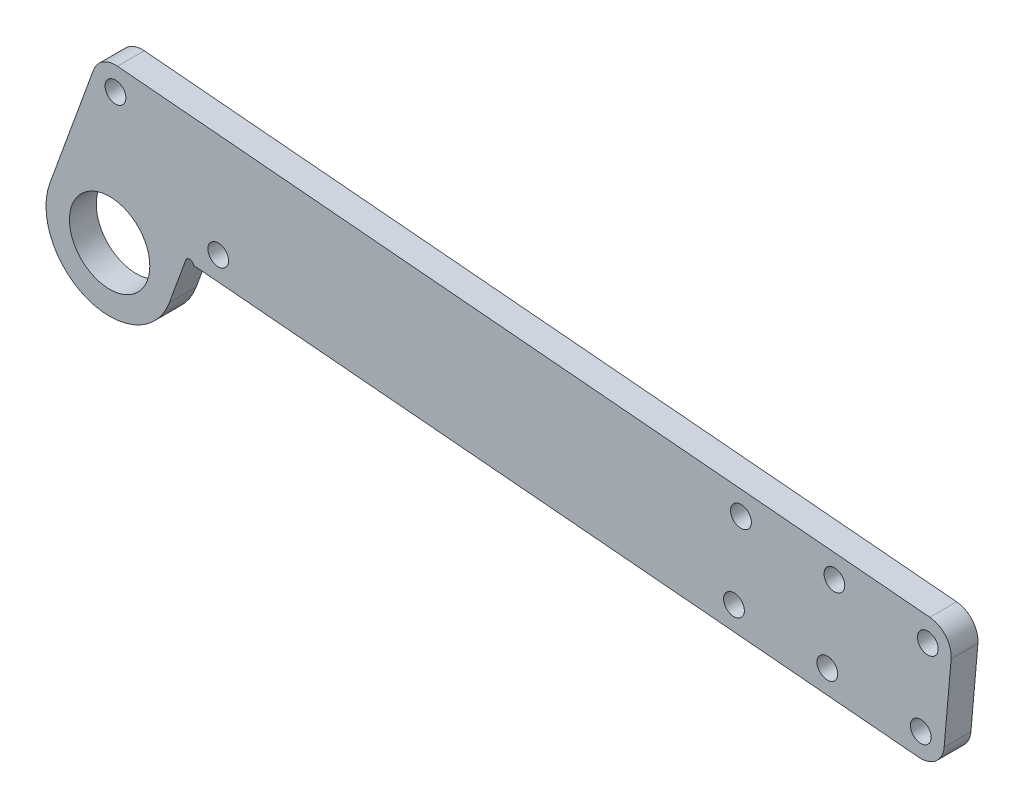
ISO-10303-21;
HEADER;
FILE_DESCRIPTION(('STEP AP214'),'2;1');
FILE_NAME('part.step','',(''),(''),'','','');
FILE_SCHEMA(('AUTOMOTIVE_DESIGN { 1 0 10303 214 1 1 1 1 }'));
ENDSEC;
DATA;
#1=APPLICATION_CONTEXT('core data for automotive mechanical design processes');
#2=APPLICATION_PROTOCOL_DEFINITION('international standard','automotive_design',2000,#1);
#3=PRODUCT_CONTEXT('',#1,'mechanical');
#4=PRODUCT('Part','Part','',(#3));
#5=PRODUCT_RELATED_PRODUCT_CATEGORY('part','',(#4));
#6=PRODUCT_DEFINITION_FORMATION('','',#4);
#7=PRODUCT_DEFINITION_CONTEXT('part definition',#1,'design');
#8=PRODUCT_DEFINITION('design','',#6,#7);
#9=PRODUCT_DEFINITION_SHAPE('','',#8);
#10=(LENGTH_UNIT() NAMED_UNIT(*) SI_UNIT(.MILLI.,.METRE.));
#11=(NAMED_UNIT(*) PLANE_ANGLE_UNIT() SI_UNIT($,.RADIAN.));
#12=(NAMED_UNIT(*) SI_UNIT($,.STERADIAN.) SOLID_ANGLE_UNIT());
#13=UNCERTAINTY_MEASURE_WITH_UNIT(LENGTH_MEASURE(1.E-05),#10,'distance_accuracy_value','');
#14=(GEOMETRIC_REPRESENTATION_CONTEXT(3) GLOBAL_UNCERTAINTY_ASSIGNED_CONTEXT((#13)) GLOBAL_UNIT_ASSIGNED_CONTEXT((#10,
#11,#12)) REPRESENTATION_CONTEXT('',''));
#15=CARTESIAN_POINT('',(0.,0.,0.));
#16=DIRECTION('',(0.,0.,1.));
#17=DIRECTION('',(1.,0.,0.));
#18=AXIS2_PLACEMENT_3D('',#15,#16,#17);
#19=CARTESIAN_POINT('',(0.,0.,2.));
#20=DIRECTION('',(0.,0.,1.));
#21=DIRECTION('',(1.,0.,0.));
#22=AXIS2_PLACEMENT_3D('',#19,#20,#21);
#23=PLANE('',#22);
#24=CARTESIAN_POINT('',(108.222712806669,10.5528446828025,2.));
#25=DIRECTION('',(0.,0.,1.));
#26=DIRECTION('',(1.,0.,0.));
#27=AXIS2_PLACEMENT_3D('',#24,#25,#26);
#28=CIRCLE('',#27,1.54999999999999);
#29=CARTESIAN_POINT('',(109.772712806669,10.5528446828025,2.));
#30=VERTEX_POINT('',#29);
#31=EDGE_CURVE('E436',#30,#30,#28,.T.);
#32=ORIENTED_EDGE('',*,*,#31,.F.);
#33=EDGE_LOOP('',(#32));
#34=FACE_BOUND('',#33,.T.);
#35=CARTESIAN_POINT('',(93.230118120413,-0.181311295831196,2.));
#36=DIRECTION('',(0.,0.,1.));
#37=DIRECTION('',(1.,0.,0.));
#38=AXIS2_PLACEMENT_3D('',#35,#36,#37);
#39=CIRCLE('',#38,1.54999999999999);
#40=CARTESIAN_POINT('',(94.780118120413,-0.181311295831196,2.));
#41=VERTEX_POINT('',#40);
#42=EDGE_CURVE('E439',#41,#41,#39,.T.);
#43=ORIENTED_EDGE('',*,*,#42,.F.);
#44=EDGE_LOOP('',(#43));
#45=FACE_BOUND('',#44,.T.);
#46=CARTESIAN_POINT('',(94.2759870333849,11.7730250812698,2.));
#47=DIRECTION('',(0.,0.,1.));
#48=DIRECTION('',(1.,0.,0.));
#49=AXIS2_PLACEMENT_3D('',#46,#47,#48);
#50=CIRCLE('',#49,1.54999999999999);
#51=CARTESIAN_POINT('',(95.8259870333849,11.7730250812698,2.));
#52=VERTEX_POINT('',#51);
#53=EDGE_CURVE('E455',#52,#52,#50,.T.);
#54=ORIENTED_EDGE('',*,*,#53,.F.);
#55=EDGE_LOOP('',(#54));
#56=FACE_BOUND('',#55,.T.);
#57=CARTESIAN_POINT('',(121.123569666982,-2.62167209276562,2.));
#58=DIRECTION('',(0.,0.,1.));
#59=DIRECTION('',(1.,0.,0.));
#60=AXIS2_PLACEMENT_3D('',#57,#58,#59);
#61=CIRCLE('',#60,1.54999999999999);
#62=CARTESIAN_POINT('',(122.673569666982,-2.62167209276562,2.));
#63=VERTEX_POINT('',#62);
#64=EDGE_CURVE('E449',#63,#63,#61,.T.);
#65=ORIENTED_EDGE('',*,*,#64,.F.);
#66=EDGE_LOOP('',(#65));
#67=FACE_BOUND('',#66,.T.);
#68=CARTESIAN_POINT('',(107.176843893697,-1.40149169429841,2.));
#69=DIRECTION('',(0.,0.,1.));
#70=DIRECTION('',(1.,0.,0.));
#71=AXIS2_PLACEMENT_3D('',#68,#69,#70);
#72=CIRCLE('',#71,1.54999999999999);
#73=CARTESIAN_POINT('',(108.726843893697,-1.40149169429841,2.));
#74=VERTEX_POINT('',#73);
#75=EDGE_CURVE('E442',#74,#74,#72,.T.);
#76=ORIENTED_EDGE('',*,*,#75,.F.);
#77=EDGE_LOOP('',(#76));
#78=FACE_BOUND('',#77,.T.);
#79=CARTESIAN_POINT('',(122.169438579954,9.33266428433532,2.));
#80=DIRECTION('',(0.,0.,1.));
#81=DIRECTION('',(1.,0.,0.));
#82=AXIS2_PLACEMENT_3D('',#79,#80,#81);
#83=CIRCLE('',#82,1.54999999999999);
#84=CARTESIAN_POINT('',(123.719438579954,9.33266428433532,2.));
#85=VERTEX_POINT('',#84);
#86=EDGE_CURVE('E200',#85,#85,#83,.T.);
#87=ORIENTED_EDGE('',*,*,#86,.F.);
#88=EDGE_LOOP('',(#87));
#89=FACE_BOUND('',#88,.T.);
#90=DIRECTION('',(0.996194698091746,-0.0871557427476583,0.));
#91=VECTOR('',#90,1.);
#92=CARTESIAN_POINT('',(11.3715785534696,3.46701349766295,2.));
#93=LINE('',#92,#91);
#94=CARTESIAN_POINT('',(12.5262787777485,3.3659903182677,2.));
#95=VERTEX_POINT('',#94);
#96=CARTESIAN_POINT('',(120.818524567365,-6.10835353608674,2.));
#97=VERTEX_POINT('',#96);
#98=EDGE_CURVE('E127',#95,#97,#93,.T.);
#99=ORIENTED_EDGE('',*,*,#98,.T.);
#100=CARTESIAN_POINT('',(121.123569666982,-2.62167209276563,2.));
#101=DIRECTION('',(0.,0.,1.));
#102=DIRECTION('',(1.,0.,0.));
#103=AXIS2_PLACEMENT_3D('',#100,#101,#102);
#104=CIRCLE('',#103,3.5);
#105=CARTESIAN_POINT('',(124.610251110303,-2.92671719238244,2.));
#106=VERTEX_POINT('',#105);
#107=EDGE_CURVE('E179',#97,#106,#104,.T.);
#108=ORIENTED_EDGE('',*,*,#107,.T.);
#109=DIRECTION('',(-0.0871557427476583,-0.996194698091746,0.));
#110=VECTOR('',#109,1.);
#111=CARTESIAN_POINT('',(125.961165122892,12.5143006280396,2.));
#112=LINE('',#111,#110);
#113=CARTESIAN_POINT('',(125.656120023275,9.02761918471851,2.));
#114=VERTEX_POINT('',#113);
#115=EDGE_CURVE('E193',#114,#106,#112,.T.);
#116=ORIENTED_EDGE('',*,*,#115,.F.);
#117=CARTESIAN_POINT('',(122.169438579954,9.33266428433532,2.));
#118=DIRECTION('',(0.,0.,1.));
#119=DIRECTION('',(1.,0.,0.));
#120=AXIS2_PLACEMENT_3D('',#117,#118,#119);
#121=CIRCLE('',#120,3.5);
#122=CARTESIAN_POINT('',(122.474483679571,12.8193457276564,2.));
#123=VERTEX_POINT('',#122);
#124=EDGE_CURVE('E177',#114,#123,#121,.T.);
#125=ORIENTED_EDGE('',*,*,#124,.T.);
#126=DIRECTION('',(-0.996194698091746,0.0871557427476583,0.));
#127=VECTOR('',#126,1.);
#128=CARTESIAN_POINT('',(-1.49619679974456,23.6653748791911,2.));
#129=LINE('',#128,#127);
#130=CARTESIAN_POINT('',(1.17922797020117,23.4313055417044,2.));
#131=VERTEX_POINT('',#130);
#132=EDGE_CURVE('E137',#123,#131,#129,.T.);
#133=ORIENTED_EDGE('',*,*,#132,.T.);
#134=CARTESIAN_POINT('',(0.874182870584366,19.9446240983833,2.));
#135=DIRECTION('',(0.,0.,1.));
#136=DIRECTION('',(1.,0.,0.));
#137=AXIS2_PLACEMENT_3D('',#134,#135,#136);
#138=CIRCLE('',#137,3.5);
#139=CARTESIAN_POINT('',(-2.41474130216632,21.1416946000231,2.));
#140=VERTEX_POINT('',#139);
#141=EDGE_CURVE('E174',#131,#140,#138,.T.);
#142=ORIENTED_EDGE('',*,*,#141,.T.);
#143=DIRECTION('',(-0.342020143325666,-0.939692620785909,0.));
#144=VECTOR('',#143,1.);
#145=CARTESIAN_POINT('',(-8.92707989746614,3.24919136159382,2.));
#146=LINE('',#145,#144);
#147=CARTESIAN_POINT('',(-8.92707989746614,3.24919136159382,2.));
#148=VERTEX_POINT('',#147);
#149=EDGE_CURVE('E139',#140,#148,#146,.T.);
#150=ORIENTED_EDGE('',*,*,#149,.T.);
#151=CARTESIAN_POINT('',(0.,0.,2.));
#152=DIRECTION('',(0.,0.,1.));
#153=DIRECTION('',(1.,0.,0.));
#154=AXIS2_PLACEMENT_3D('',#151,#152,#153);
#155=CIRCLE('',#154,9.5);
#156=CARTESIAN_POINT('',(8.92707989746614,-3.24919136159382,2.));
#157=VERTEX_POINT('',#156);
#158=EDGE_CURVE('E141',#148,#157,#155,.T.);
#159=ORIENTED_EDGE('',*,*,#158,.T.);
#160=DIRECTION('',(0.342020143325666,0.939692620785909,0.));
#161=VECTOR('',#160,1.);
#162=CARTESIAN_POINT('',(8.92707989746614,-3.24919136159382,2.));
#163=LINE('',#162,#161);
#164=CARTESIAN_POINT('',(11.3715785534696,3.46701349766295,2.));
#165=VERTEX_POINT('',#164);
#166=EDGE_CURVE('E129',#157,#165,#163,.T.);
#167=ORIENTED_EDGE('',*,*,#166,.T.);
#168=CARTESIAN_POINT('',(11.9353941259412,3.26180141166755,2.));
#169=DIRECTION('',(0.,0.,1.));
#170=DIRECTION('',(1.,0.,0.));
#171=AXIS2_PLACEMENT_3D('',#168,#169,#170);
#172=CIRCLE('',#171,0.6);
#173=EDGE_CURVE('E113',#95,#165,#172,.T.);
#174=ORIENTED_EDGE('',*,*,#173,.F.);
#175=EDGE_LOOP('',(#99,#108,#116,#125,#133,#142,#150,#159,#167,#174));
#176=FACE_BOUND('',#175,.T.);
#177=CARTESIAN_POINT('',(0.874182870584366,19.9446240983833,2.));
#178=DIRECTION('',(0.,0.,1.));
#179=DIRECTION('',(1.,0.,0.));
#180=AXIS2_PLACEMENT_3D('',#177,#178,#179);
#181=CIRCLE('',#180,1.55);
#182=CARTESIAN_POINT('',(2.42418287058437,19.9446240983833,2.));
#183=VERTEX_POINT('',#182);
#184=EDGE_CURVE('E208',#183,#183,#181,.T.);
#185=ORIENTED_EDGE('',*,*,#184,.F.);
#186=EDGE_LOOP('',(#185));
#187=FACE_BOUND('',#186,.T.);
#188=CARTESIAN_POINT('',(16.2205553770371,6.55615242730257,2.));
#189=DIRECTION('',(0.,0.,1.));
#190=DIRECTION('',(1.,0.,0.));
#191=AXIS2_PLACEMENT_3D('',#188,#189,#190);
#192=CIRCLE('',#191,1.55);
#193=CARTESIAN_POINT('',(17.7705553770371,6.55615242730257,2.));
#194=VERTEX_POINT('',#193);
#195=EDGE_CURVE('E214',#194,#194,#192,.T.);
#196=ORIENTED_EDGE('',*,*,#195,.F.);
#197=EDGE_LOOP('',(#196));
#198=FACE_BOUND('',#197,.T.);
#199=CARTESIAN_POINT('',(0.,0.,2.));
#200=DIRECTION('',(0.,0.,1.));
#201=DIRECTION('',(1.,0.,0.));
#202=AXIS2_PLACEMENT_3D('',#199,#200,#201);
#203=CIRCLE('',#202,6.);
#204=CARTESIAN_POINT('',(6.,0.,2.));
#205=VERTEX_POINT('',#204);
#206=EDGE_CURVE('E151',#205,#205,#203,.T.);
#207=ORIENTED_EDGE('',*,*,#206,.F.);
#208=EDGE_LOOP('',(#207));
#209=FACE_BOUND('',#208,.T.);
#210=ADVANCED_FACE('F33',(#34,#45,#56,#67,#78,#89,#176,#187,#198,#209),#23,.T.);
#211=CARTESIAN_POINT('',(0.,0.,-2.));
#212=DIRECTION('',(0.,0.,1.));
#213=DIRECTION('',(1.,0.,0.));
#214=AXIS2_PLACEMENT_3D('',#211,#212,#213);
#215=PLANE('',#214);
#216=CARTESIAN_POINT('',(108.222712806669,10.5528446828025,-2.));
#217=DIRECTION('',(0.,0.,1.));
#218=DIRECTION('',(1.,0.,0.));
#219=AXIS2_PLACEMENT_3D('',#216,#217,#218);
#220=CIRCLE('',#219,1.54999999999999);
#221=CARTESIAN_POINT('',(109.772712806669,10.5528446828025,-2.));
#222=VERTEX_POINT('',#221);
#223=EDGE_CURVE('E434',#222,#222,#220,.T.);
#224=ORIENTED_EDGE('',*,*,#223,.T.);
#225=EDGE_LOOP('',(#224));
#226=FACE_BOUND('',#225,.T.);
#227=CARTESIAN_POINT('',(93.230118120413,-0.181311295831196,-2.));
#228=DIRECTION('',(0.,0.,1.));
#229=DIRECTION('',(1.,0.,0.));
#230=AXIS2_PLACEMENT_3D('',#227,#228,#229);
#231=CIRCLE('',#230,1.54999999999999);
#232=CARTESIAN_POINT('',(94.780118120413,-0.181311295831196,-2.));
#233=VERTEX_POINT('',#232);
#234=EDGE_CURVE('E457',#233,#233,#231,.T.);
#235=ORIENTED_EDGE('',*,*,#234,.T.);
#236=EDGE_LOOP('',(#235));
#237=FACE_BOUND('',#236,.T.);
#238=CARTESIAN_POINT('',(94.2759870333849,11.7730250812698,-2.));
#239=DIRECTION('',(0.,0.,1.));
#240=DIRECTION('',(1.,0.,0.));
#241=AXIS2_PLACEMENT_3D('',#238,#239,#240);
#242=CIRCLE('',#241,1.54999999999999);
#243=CARTESIAN_POINT('',(95.8259870333849,11.7730250812698,-2.));
#244=VERTEX_POINT('',#243);
#245=EDGE_CURVE('E452',#244,#244,#242,.T.);
#246=ORIENTED_EDGE('',*,*,#245,.T.);
#247=EDGE_LOOP('',(#246));
#248=FACE_BOUND('',#247,.T.);
#249=CARTESIAN_POINT('',(121.123569666982,-2.62167209276562,-2.));
#250=DIRECTION('',(0.,0.,1.));
#251=DIRECTION('',(1.,0.,0.));
#252=AXIS2_PLACEMENT_3D('',#249,#250,#251);
#253=CIRCLE('',#252,1.54999999999999);
#254=CARTESIAN_POINT('',(122.673569666982,-2.62167209276562,-2.));
#255=VERTEX_POINT('',#254);
#256=EDGE_CURVE('E446',#255,#255,#253,.T.);
#257=ORIENTED_EDGE('',*,*,#256,.T.);
#258=EDGE_LOOP('',(#257));
#259=FACE_BOUND('',#258,.T.);
#260=CARTESIAN_POINT('',(107.176843893697,-1.40149169429841,-2.));
#261=DIRECTION('',(0.,0.,1.));
#262=DIRECTION('',(1.,0.,0.));
#263=AXIS2_PLACEMENT_3D('',#260,#261,#262);
#264=CIRCLE('',#263,1.54999999999999);
#265=CARTESIAN_POINT('',(108.726843893697,-1.40149169429841,-2.));
#266=VERTEX_POINT('',#265);
#267=EDGE_CURVE('E437',#266,#266,#264,.T.);
#268=ORIENTED_EDGE('',*,*,#267,.T.);
#269=EDGE_LOOP('',(#268));
#270=FACE_BOUND('',#269,.T.);
#271=CARTESIAN_POINT('',(122.169438579954,9.33266428433532,-2.));
#272=DIRECTION('',(0.,0.,1.));
#273=DIRECTION('',(1.,0.,0.));
#274=AXIS2_PLACEMENT_3D('',#271,#272,#273);
#275=CIRCLE('',#274,1.54999999999999);
#276=CARTESIAN_POINT('',(123.719438579954,9.33266428433532,-2.));
#277=VERTEX_POINT('',#276);
#278=EDGE_CURVE('E196',#277,#277,#275,.T.);
#279=ORIENTED_EDGE('',*,*,#278,.T.);
#280=EDGE_LOOP('',(#279));
#281=FACE_BOUND('',#280,.T.);
#282=CARTESIAN_POINT('',(0.874182870584366,19.9446240983833,-2.));
#283=DIRECTION('',(0.,0.,1.));
#284=DIRECTION('',(1.,0.,0.));
#285=AXIS2_PLACEMENT_3D('',#282,#283,#284);
#286=CIRCLE('',#285,1.55);
#287=CARTESIAN_POINT('',(2.42418287058437,19.9446240983833,-2.));
#288=VERTEX_POINT('',#287);
#289=EDGE_CURVE('E204',#288,#288,#286,.T.);
#290=ORIENTED_EDGE('',*,*,#289,.T.);
#291=EDGE_LOOP('',(#290));
#292=FACE_BOUND('',#291,.T.);
#293=CARTESIAN_POINT('',(16.2205553770371,6.55615242730257,-2.));
#294=DIRECTION('',(0.,0.,1.));
#295=DIRECTION('',(1.,0.,0.));
#296=AXIS2_PLACEMENT_3D('',#293,#294,#295);
#297=CIRCLE('',#296,1.55);
#298=CARTESIAN_POINT('',(17.7705553770371,6.55615242730257,-2.));
#299=VERTEX_POINT('',#298);
#300=EDGE_CURVE('E211',#299,#299,#297,.T.);
#301=ORIENTED_EDGE('',*,*,#300,.T.);
#302=EDGE_LOOP('',(#301));
#303=FACE_BOUND('',#302,.T.);
#304=DIRECTION('',(-0.0871557427476583,-0.996194698091746,0.));
#305=VECTOR('',#304,1.);
#306=CARTESIAN_POINT('',(125.961165122892,12.5143006280396,-2.));
#307=LINE('',#306,#305);
#308=CARTESIAN_POINT('',(125.656120023275,9.02761918471851,-2.));
#309=VERTEX_POINT('',#308);
#310=CARTESIAN_POINT('',(124.610251110303,-2.92671719238244,-2.));
#311=VERTEX_POINT('',#310);
#312=EDGE_CURVE('E131',#309,#311,#307,.T.);
#313=ORIENTED_EDGE('',*,*,#312,.T.);
#314=CARTESIAN_POINT('',(121.123569666982,-2.62167209276563,-2.));
#315=DIRECTION('',(0.,0.,1.));
#316=DIRECTION('',(1.,0.,0.));
#317=AXIS2_PLACEMENT_3D('',#314,#315,#316);
#318=CIRCLE('',#317,3.5);
#319=CARTESIAN_POINT('',(120.818524567365,-6.10835353608674,-2.));
#320=VERTEX_POINT('',#319);
#321=EDGE_CURVE('E41',#311,#320,#318,.F.);
#322=ORIENTED_EDGE('',*,*,#321,.T.);
#323=DIRECTION('',(0.996194698091746,-0.0871557427476583,0.));
#324=VECTOR('',#323,1.);
#325=CARTESIAN_POINT('',(11.3715785534696,3.46701349766295,-2.));
#326=LINE('',#325,#324);
#327=CARTESIAN_POINT('',(12.5262787777485,3.3659903182677,-2.));
#328=VERTEX_POINT('',#327);
#329=EDGE_CURVE('E154',#328,#320,#326,.T.);
#330=ORIENTED_EDGE('',*,*,#329,.F.);
#331=CARTESIAN_POINT('',(11.9353941259412,3.26180141166755,-2.));
#332=DIRECTION('',(0.,0.,1.));
#333=DIRECTION('',(1.,0.,0.));
#334=AXIS2_PLACEMENT_3D('',#331,#332,#333);
#335=CIRCLE('',#334,0.6);
#336=CARTESIAN_POINT('',(11.3715785534696,3.46701349766295,-2.));
#337=VERTEX_POINT('',#336);
#338=EDGE_CURVE('E116',#328,#337,#335,.T.);
#339=ORIENTED_EDGE('',*,*,#338,.T.);
#340=DIRECTION('',(0.342020143325666,0.939692620785909,0.));
#341=VECTOR('',#340,1.);
#342=CARTESIAN_POINT('',(8.92707989746614,-3.24919136159382,-2.));
#343=LINE('',#342,#341);
#344=CARTESIAN_POINT('',(8.92707989746614,-3.24919136159382,-2.));
#345=VERTEX_POINT('',#344);
#346=EDGE_CURVE('E150',#345,#337,#343,.T.);
#347=ORIENTED_EDGE('',*,*,#346,.F.);
#348=CARTESIAN_POINT('',(0.,0.,-2.));
#349=DIRECTION('',(0.,0.,1.));
#350=DIRECTION('',(1.,0.,0.));
#351=AXIS2_PLACEMENT_3D('',#348,#349,#350);
#352=CIRCLE('',#351,9.5);
#353=CARTESIAN_POINT('',(-8.92707989746614,3.24919136159382,-2.));
#354=VERTEX_POINT('',#353);
#355=EDGE_CURVE('E147',#354,#345,#352,.T.);
#356=ORIENTED_EDGE('',*,*,#355,.F.);
#357=DIRECTION('',(-0.342020143325666,-0.939692620785909,0.));
#358=VECTOR('',#357,1.);
#359=CARTESIAN_POINT('',(-8.92707989746614,3.24919136159382,-2.));
#360=LINE('',#359,#358);
#361=CARTESIAN_POINT('',(-2.41474130216632,21.1416946000231,-2.));
#362=VERTEX_POINT('',#361);
#363=EDGE_CURVE('E158',#362,#354,#360,.T.);
#364=ORIENTED_EDGE('',*,*,#363,.F.);
#365=CARTESIAN_POINT('',(0.874182870584366,19.9446240983833,-2.));
#366=DIRECTION('',(0.,0.,1.));
#367=DIRECTION('',(1.,0.,0.));
#368=AXIS2_PLACEMENT_3D('',#365,#366,#367);
#369=CIRCLE('',#368,3.5);
#370=CARTESIAN_POINT('',(1.17922797020117,23.4313055417044,-2.));
#371=VERTEX_POINT('',#370);
#372=EDGE_CURVE('E168',#362,#371,#369,.F.);
#373=ORIENTED_EDGE('',*,*,#372,.T.);
#374=DIRECTION('',(-0.996194698091746,0.0871557427476583,0.));
#375=VECTOR('',#374,1.);
#376=CARTESIAN_POINT('',(-1.49619679974456,23.6653748791911,-2.));
#377=LINE('',#376,#375);
#378=CARTESIAN_POINT('',(122.474483679571,12.8193457276564,-2.));
#379=VERTEX_POINT('',#378);
#380=EDGE_CURVE('E156',#379,#371,#377,.T.);
#381=ORIENTED_EDGE('',*,*,#380,.F.);
#382=CARTESIAN_POINT('',(122.169438579954,9.33266428433532,-2.));
#383=DIRECTION('',(0.,0.,1.));
#384=DIRECTION('',(1.,0.,0.));
#385=AXIS2_PLACEMENT_3D('',#382,#383,#384);
#386=CIRCLE('',#385,3.5);
#387=EDGE_CURVE('E185',#379,#309,#386,.F.);
#388=ORIENTED_EDGE('',*,*,#387,.T.);
#389=EDGE_LOOP('',(#313,#322,#330,#339,#347,#356,#364,#373,#381,#388));
#390=FACE_BOUND('',#389,.T.);
#391=CARTESIAN_POINT('',(0.,0.,-2.));
#392=DIRECTION('',(0.,0.,1.));
#393=DIRECTION('',(1.,0.,0.));
#394=AXIS2_PLACEMENT_3D('',#391,#392,#393);
#395=CIRCLE('',#394,6.);
#396=CARTESIAN_POINT('',(6.,0.,-2.));
#397=VERTEX_POINT('',#396);
#398=EDGE_CURVE('E207',#397,#397,#395,.T.);
#399=ORIENTED_EDGE('',*,*,#398,.T.);
#400=EDGE_LOOP('',(#399));
#401=FACE_BOUND('',#400,.T.);
#402=ADVANCED_FACE('F188',(#226,#237,#248,#259,#270,#281,#292,#303,#390,#401),#215,.F.);
#403=CARTESIAN_POINT('',(0.,0.,2.));
#404=DIRECTION('',(0.,0.,-1.));
#405=DIRECTION('',(-1.,0.,0.));
#406=AXIS2_PLACEMENT_3D('',#403,#404,#405);
#407=CYLINDRICAL_SURFACE('',#406,9.5);
#408=ORIENTED_EDGE('',*,*,#355,.T.);
#409=DIRECTION('',(0.,0.,-1.));
#410=VECTOR('',#409,1.);
#411=CARTESIAN_POINT('',(8.92707989746614,-3.24919136159382,2.));
#412=LINE('',#411,#410);
#413=EDGE_CURVE('E122',#157,#345,#412,.T.);
#414=ORIENTED_EDGE('',*,*,#413,.F.);
#415=ORIENTED_EDGE('',*,*,#158,.F.);
#416=DIRECTION('',(0.,0.,-1.));
#417=VECTOR('',#416,1.);
#418=CARTESIAN_POINT('',(-8.92707989746614,3.24919136159382,2.));
#419=LINE('',#418,#417);
#420=EDGE_CURVE('E146',#148,#354,#419,.T.);
#421=ORIENTED_EDGE('',*,*,#420,.T.);
#422=EDGE_LOOP('',(#408,#414,#415,#421));
#423=FACE_BOUND('',#422,.T.);
#424=ADVANCED_FACE('F226',(#423),#407,.T.);
#425=CARTESIAN_POINT('',(8.92707989746614,-3.24919136159382,2.));
#426=DIRECTION('',(-0.939692620785909,0.342020143325666,0.));
#427=DIRECTION('',(-0.342020143325666,-0.93969262078591,0.));
#428=AXIS2_PLACEMENT_3D('',#425,#426,#427);
#429=PLANE('',#428);
#430=ORIENTED_EDGE('',*,*,#346,.T.);
#431=DIRECTION('',(0.,0.,-1.));
#432=VECTOR('',#431,1.);
#433=CARTESIAN_POINT('',(11.3715785534696,3.46701349766295,2.));
#434=LINE('',#433,#432);
#435=EDGE_CURVE('E162',#165,#337,#434,.T.);
#436=ORIENTED_EDGE('',*,*,#435,.F.);
#437=ORIENTED_EDGE('',*,*,#166,.F.);
#438=ORIENTED_EDGE('',*,*,#413,.T.);
#439=EDGE_LOOP('',(#430,#436,#437,#438));
#440=FACE_BOUND('',#439,.T.);
#441=ADVANCED_FACE('F229',(#440),#429,.F.);
#442=CARTESIAN_POINT('',(11.3715785534696,3.46701349766295,2.));
#443=DIRECTION('',(0.0871557427476583,0.996194698091746,0.));
#444=DIRECTION('',(-0.996194698091746,0.0871557427476583,0.));
#445=AXIS2_PLACEMENT_3D('',#442,#443,#444);
#446=PLANE('',#445);
#447=ORIENTED_EDGE('',*,*,#329,.T.);
#448=DIRECTION('',(0.,0.,1.));
#449=VECTOR('',#448,1.);
#450=CARTESIAN_POINT('',(120.818524567365,-6.10835353608674,2.));
#451=LINE('',#450,#449);
#452=EDGE_CURVE('E136',#320,#97,#451,.T.);
#453=ORIENTED_EDGE('',*,*,#452,.T.);
#454=ORIENTED_EDGE('',*,*,#98,.F.);
#455=DIRECTION('',(0.,0.,1.));
#456=VECTOR('',#455,1.);
#457=CARTESIAN_POINT('',(12.5262787777485,3.3659903182677,-2.));
#458=LINE('',#457,#456);
#459=EDGE_CURVE('E110',#95,#328,#458,.F.);
#460=ORIENTED_EDGE('',*,*,#459,.T.);
#461=EDGE_LOOP('',(#447,#453,#454,#460));
#462=FACE_BOUND('',#461,.T.);
#463=ADVANCED_FACE('F134',(#462),#446,.F.);
#464=CARTESIAN_POINT('',(-1.49619679974456,23.6653748791911,2.));
#465=DIRECTION('',(-0.0871557427476583,-0.996194698091746,0.));
#466=DIRECTION('',(0.996194698091746,-0.0871557427476583,0.));
#467=AXIS2_PLACEMENT_3D('',#464,#465,#466);
#468=PLANE('',#467);
#469=ORIENTED_EDGE('',*,*,#132,.F.);
#470=DIRECTION('',(0.,0.,1.));
#471=VECTOR('',#470,1.);
#472=CARTESIAN_POINT('',(122.474483679571,12.8193457276564,2.));
#473=LINE('',#472,#471);
#474=EDGE_CURVE('E11',#123,#379,#473,.F.);
#475=ORIENTED_EDGE('',*,*,#474,.T.);
#476=ORIENTED_EDGE('',*,*,#380,.T.);
#477=DIRECTION('',(0.,0.,-1.));
#478=VECTOR('',#477,1.);
#479=CARTESIAN_POINT('',(1.17922797020117,23.4313055417044,2.));
#480=LINE('',#479,#478);
#481=EDGE_CURVE('E171',#371,#131,#480,.F.);
#482=ORIENTED_EDGE('',*,*,#481,.T.);
#483=EDGE_LOOP('',(#469,#475,#476,#482));
#484=FACE_BOUND('',#483,.T.);
#485=ADVANCED_FACE('F238',(#484),#468,.F.);
#486=CARTESIAN_POINT('',(-8.92707989746614,3.24919136159382,2.));
#487=DIRECTION('',(0.939692620785909,-0.342020143325666,0.));
#488=DIRECTION('',(0.342020143325666,0.93969262078591,0.));
#489=AXIS2_PLACEMENT_3D('',#486,#487,#488);
#490=PLANE('',#489);
#491=ORIENTED_EDGE('',*,*,#149,.F.);
#492=DIRECTION('',(0.,0.,-1.));
#493=VECTOR('',#492,1.);
#494=CARTESIAN_POINT('',(-2.41474130216632,21.1416946000231,2.));
#495=LINE('',#494,#493);
#496=EDGE_CURVE('E121',#140,#362,#495,.T.);
#497=ORIENTED_EDGE('',*,*,#496,.T.);
#498=ORIENTED_EDGE('',*,*,#363,.T.);
#499=ORIENTED_EDGE('',*,*,#420,.F.);
#500=EDGE_LOOP('',(#491,#497,#498,#499));
#501=FACE_BOUND('',#500,.T.);
#502=ADVANCED_FACE('F233',(#501),#490,.F.);
#503=CARTESIAN_POINT('',(0.,0.,2.));
#504=DIRECTION('',(0.,0.,-1.));
#505=DIRECTION('',(-1.,0.,0.));
#506=AXIS2_PLACEMENT_3D('',#503,#504,#505);
#507=CYLINDRICAL_SURFACE('',#506,6.);
#508=ORIENTED_EDGE('',*,*,#206,.T.);
#509=EDGE_LOOP('',(#508));
#510=FACE_BOUND('',#509,.T.);
#511=ORIENTED_EDGE('',*,*,#398,.F.);
#512=EDGE_LOOP('',(#511));
#513=FACE_BOUND('',#512,.T.);
#514=ADVANCED_FACE('F258',(#510,#513),#507,.F.);
#515=CARTESIAN_POINT('',(11.9353941259412,3.26180141166755,-2.));
#516=DIRECTION('',(0.,0.,1.));
#517=DIRECTION('',(1.,0.,0.));
#518=AXIS2_PLACEMENT_3D('',#515,#516,#517);
#519=CYLINDRICAL_SURFACE('',#518,0.6);
#520=ORIENTED_EDGE('',*,*,#338,.F.);
#521=ORIENTED_EDGE('',*,*,#459,.F.);
#522=ORIENTED_EDGE('',*,*,#173,.T.);
#523=ORIENTED_EDGE('',*,*,#435,.T.);
#524=EDGE_LOOP('',(#520,#521,#522,#523));
#525=FACE_BOUND('',#524,.T.);
#526=ADVANCED_FACE('F112',(#525),#519,.F.);
#527=CARTESIAN_POINT('',(16.2205553770371,6.55615242730257,-2.));
#528=DIRECTION('',(0.,0.,1.));
#529=DIRECTION('',(1.,0.,0.));
#530=AXIS2_PLACEMENT_3D('',#527,#528,#529);
#531=CYLINDRICAL_SURFACE('',#530,1.55);
#532=ORIENTED_EDGE('',*,*,#300,.F.);
#533=EDGE_LOOP('',(#532));
#534=FACE_BOUND('',#533,.T.);
#535=ORIENTED_EDGE('',*,*,#195,.T.);
#536=EDGE_LOOP('',(#535));
#537=FACE_BOUND('',#536,.T.);
#538=ADVANCED_FACE('F280',(#534,#537),#531,.F.);
#539=CARTESIAN_POINT('',(0.874182870584366,19.9446240983833,-2.));
#540=DIRECTION('',(0.,0.,1.));
#541=DIRECTION('',(1.,0.,0.));
#542=AXIS2_PLACEMENT_3D('',#539,#540,#541);
#543=CYLINDRICAL_SURFACE('',#542,1.55);
#544=ORIENTED_EDGE('',*,*,#289,.F.);
#545=EDGE_LOOP('',(#544));
#546=FACE_BOUND('',#545,.T.);
#547=ORIENTED_EDGE('',*,*,#184,.T.);
#548=EDGE_LOOP('',(#547));
#549=FACE_BOUND('',#548,.T.);
#550=ADVANCED_FACE('F272',(#546,#549),#543,.F.);
#551=CARTESIAN_POINT('',(0.874182870584366,19.9446240983833,2.));
#552=DIRECTION('',(0.,0.,-1.));
#553=DIRECTION('',(-1.,0.,0.));
#554=AXIS2_PLACEMENT_3D('',#551,#552,#553);
#555=CYLINDRICAL_SURFACE('',#554,3.5);
#556=ORIENTED_EDGE('',*,*,#141,.F.);
#557=ORIENTED_EDGE('',*,*,#481,.F.);
#558=ORIENTED_EDGE('',*,*,#372,.F.);
#559=ORIENTED_EDGE('',*,*,#496,.F.);
#560=EDGE_LOOP('',(#556,#557,#558,#559));
#561=FACE_BOUND('',#560,.T.);
#562=ADVANCED_FACE('F237',(#561),#555,.T.);
#563=CARTESIAN_POINT('',(125.961165122892,12.5143006280396,-2.));
#564=DIRECTION('',(-0.996194698091746,0.0871557427476583,0.));
#565=DIRECTION('',(-0.0871557427476583,-0.996194698091746,0.));
#566=AXIS2_PLACEMENT_3D('',#563,#564,#565);
#567=PLANE('',#566);
#568=ORIENTED_EDGE('',*,*,#115,.T.);
#569=DIRECTION('',(0.,0.,1.));
#570=VECTOR('',#569,1.);
#571=CARTESIAN_POINT('',(124.610251110303,-2.92671719238244,-2.));
#572=LINE('',#571,#570);
#573=EDGE_CURVE('E54',#106,#311,#572,.F.);
#574=ORIENTED_EDGE('',*,*,#573,.T.);
#575=ORIENTED_EDGE('',*,*,#312,.F.);
#576=DIRECTION('',(0.,0.,1.));
#577=VECTOR('',#576,1.);
#578=CARTESIAN_POINT('',(125.656120023275,9.02761918471851,-2.));
#579=LINE('',#578,#577);
#580=EDGE_CURVE('E181',#309,#114,#579,.T.);
#581=ORIENTED_EDGE('',*,*,#580,.T.);
#582=EDGE_LOOP('',(#568,#574,#575,#581));
#583=FACE_BOUND('',#582,.T.);
#584=ADVANCED_FACE('F194',(#583),#567,.F.);
#585=CARTESIAN_POINT('',(122.169438579954,9.33266428433532,-2.));
#586=DIRECTION('',(0.,0.,1.));
#587=DIRECTION('',(1.,0.,0.));
#588=AXIS2_PLACEMENT_3D('',#585,#586,#587);
#589=CYLINDRICAL_SURFACE('',#588,1.54999999999999);
#590=ORIENTED_EDGE('',*,*,#278,.F.);
#591=EDGE_LOOP('',(#590));
#592=FACE_BOUND('',#591,.T.);
#593=ORIENTED_EDGE('',*,*,#86,.T.);
#594=EDGE_LOOP('',(#593));
#595=FACE_BOUND('',#594,.T.);
#596=ADVANCED_FACE('F278',(#592,#595),#589,.F.);
#597=CARTESIAN_POINT('',(107.176843893697,-1.40149169429841,-2.));
#598=DIRECTION('',(0.,0.,1.));
#599=DIRECTION('',(1.,0.,0.));
#600=AXIS2_PLACEMENT_3D('',#597,#598,#599);
#601=CYLINDRICAL_SURFACE('',#600,1.54999999999999);
#602=ORIENTED_EDGE('',*,*,#267,.F.);
#603=EDGE_LOOP('',(#602));
#604=FACE_BOUND('',#603,.T.);
#605=ORIENTED_EDGE('',*,*,#75,.T.);
#606=EDGE_LOOP('',(#605));
#607=FACE_BOUND('',#606,.T.);
#608=ADVANCED_FACE('F370',(#604,#607),#601,.F.);
#609=CARTESIAN_POINT('',(121.123569666982,-2.62167209276562,-2.));
#610=DIRECTION('',(0.,0.,1.));
#611=DIRECTION('',(1.,0.,0.));
#612=AXIS2_PLACEMENT_3D('',#609,#610,#611);
#613=CYLINDRICAL_SURFACE('',#612,1.54999999999999);
#614=ORIENTED_EDGE('',*,*,#256,.F.);
#615=EDGE_LOOP('',(#614));
#616=FACE_BOUND('',#615,.T.);
#617=ORIENTED_EDGE('',*,*,#64,.T.);
#618=EDGE_LOOP('',(#617));
#619=FACE_BOUND('',#618,.T.);
#620=ADVANCED_FACE('F378',(#616,#619),#613,.F.);
#621=CARTESIAN_POINT('',(94.2759870333849,11.7730250812698,-2.));
#622=DIRECTION('',(0.,0.,1.));
#623=DIRECTION('',(1.,0.,0.));
#624=AXIS2_PLACEMENT_3D('',#621,#622,#623);
#625=CYLINDRICAL_SURFACE('',#624,1.54999999999999);
#626=ORIENTED_EDGE('',*,*,#245,.F.);
#627=EDGE_LOOP('',(#626));
#628=FACE_BOUND('',#627,.T.);
#629=ORIENTED_EDGE('',*,*,#53,.T.);
#630=EDGE_LOOP('',(#629));
#631=FACE_BOUND('',#630,.T.);
#632=ADVANCED_FACE('F387',(#628,#631),#625,.F.);
#633=CARTESIAN_POINT('',(93.230118120413,-0.181311295831196,-2.));
#634=DIRECTION('',(0.,0.,1.));
#635=DIRECTION('',(1.,0.,0.));
#636=AXIS2_PLACEMENT_3D('',#633,#634,#635);
#637=CYLINDRICAL_SURFACE('',#636,1.54999999999999);
#638=ORIENTED_EDGE('',*,*,#234,.F.);
#639=EDGE_LOOP('',(#638));
#640=FACE_BOUND('',#639,.T.);
#641=ORIENTED_EDGE('',*,*,#42,.T.);
#642=EDGE_LOOP('',(#641));
#643=FACE_BOUND('',#642,.T.);
#644=ADVANCED_FACE('F396',(#640,#643),#637,.F.);
#645=CARTESIAN_POINT('',(108.222712806669,10.5528446828025,-2.));
#646=DIRECTION('',(0.,0.,1.));
#647=DIRECTION('',(1.,0.,0.));
#648=AXIS2_PLACEMENT_3D('',#645,#646,#647);
#649=CYLINDRICAL_SURFACE('',#648,1.54999999999999);
#650=ORIENTED_EDGE('',*,*,#223,.F.);
#651=EDGE_LOOP('',(#650));
#652=FACE_BOUND('',#651,.T.);
#653=ORIENTED_EDGE('',*,*,#31,.T.);
#654=EDGE_LOOP('',(#653));
#655=FACE_BOUND('',#654,.T.);
#656=ADVANCED_FACE('F245',(#652,#655),#649,.F.);
#657=CARTESIAN_POINT('',(121.123569666982,-2.62167209276563,2.));
#658=DIRECTION('',(0.,0.,1.));
#659=DIRECTION('',(1.,0.,0.));
#660=AXIS2_PLACEMENT_3D('',#657,#658,#659);
#661=CYLINDRICAL_SURFACE('',#660,3.5);
#662=ORIENTED_EDGE('',*,*,#321,.F.);
#663=ORIENTED_EDGE('',*,*,#573,.F.);
#664=ORIENTED_EDGE('',*,*,#107,.F.);
#665=ORIENTED_EDGE('',*,*,#452,.F.);
#666=EDGE_LOOP('',(#662,#663,#664,#665));
#667=FACE_BOUND('',#666,.T.);
#668=ADVANCED_FACE('F191',(#667),#661,.T.);
#669=CARTESIAN_POINT('',(122.169438579954,9.33266428433532,-2.));
#670=DIRECTION('',(0.,0.,1.));
#671=DIRECTION('',(1.,0.,0.));
#672=AXIS2_PLACEMENT_3D('',#669,#670,#671);
#673=CYLINDRICAL_SURFACE('',#672,3.5);
#674=ORIENTED_EDGE('',*,*,#387,.F.);
#675=ORIENTED_EDGE('',*,*,#474,.F.);
#676=ORIENTED_EDGE('',*,*,#124,.F.);
#677=ORIENTED_EDGE('',*,*,#580,.F.);
#678=EDGE_LOOP('',(#674,#675,#676,#677));
#679=FACE_BOUND('',#678,.T.);
#680=ADVANCED_FACE('F35',(#679),#673,.T.);
#681=CLOSED_SHELL('',(#210,#402,#424,#441,#463,#485,#502,#514,#526,#538,#550,#562,#584,#596,
#608,#620,#632,#644,#656,#668,#680));
#682=MANIFOLD_SOLID_BREP('B2',#681);
#683=ADVANCED_BREP_SHAPE_REPRESENTATION('',(#18,#682),#14);
#684=SHAPE_DEFINITION_REPRESENTATION(#9,#683);
ENDSEC;
END-ISO-10303-21;
